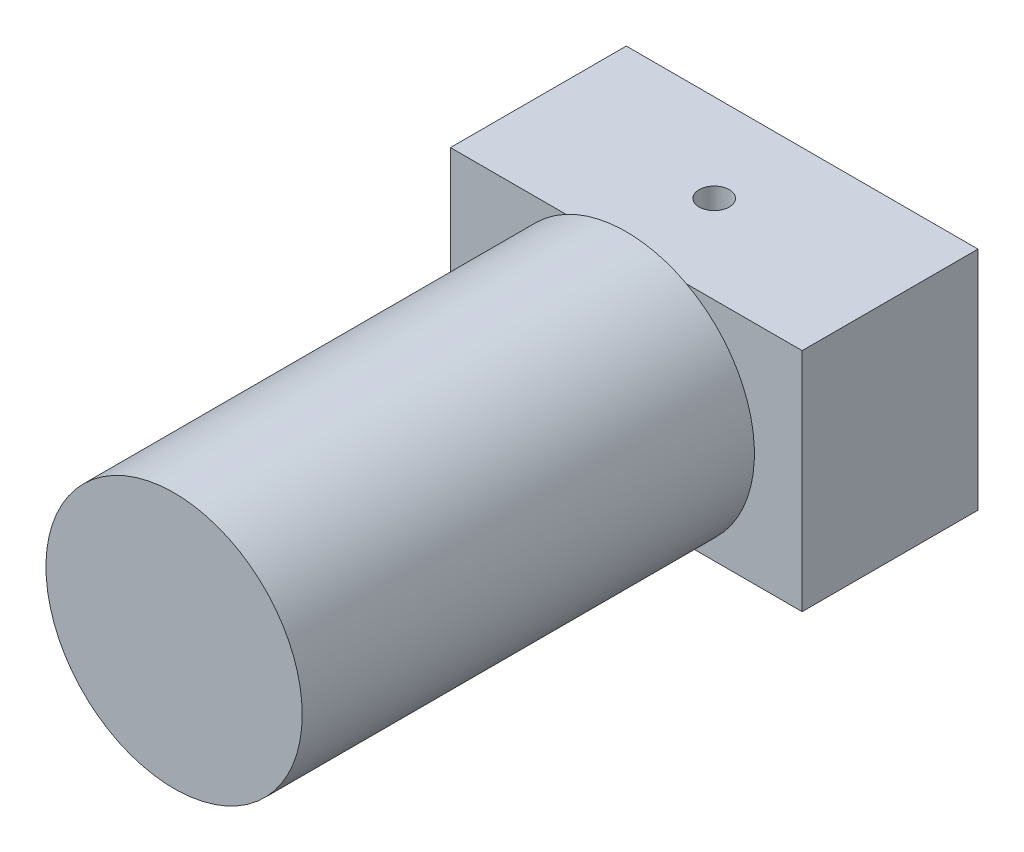
ISO-10303-21;
HEADER;
FILE_DESCRIPTION(('STEP AP214'),'2;1');
FILE_NAME('part.step','',(''),(''),'','','');
FILE_SCHEMA(('AUTOMOTIVE_DESIGN { 1 0 10303 214 1 1 1 1 }'));
ENDSEC;
DATA;
#1=APPLICATION_CONTEXT('core data for automotive mechanical design processes');
#2=APPLICATION_PROTOCOL_DEFINITION('international standard','automotive_design',2000,#1);
#3=PRODUCT_CONTEXT('',#1,'mechanical');
#4=PRODUCT('Part','Part','',(#3));
#5=PRODUCT_RELATED_PRODUCT_CATEGORY('part','',(#4));
#6=PRODUCT_DEFINITION_FORMATION('','',#4);
#7=PRODUCT_DEFINITION_CONTEXT('part definition',#1,'design');
#8=PRODUCT_DEFINITION('design','',#6,#7);
#9=PRODUCT_DEFINITION_SHAPE('','',#8);
#10=(LENGTH_UNIT() NAMED_UNIT(*) SI_UNIT(.MILLI.,.METRE.));
#11=(NAMED_UNIT(*) PLANE_ANGLE_UNIT() SI_UNIT($,.RADIAN.));
#12=(NAMED_UNIT(*) SI_UNIT($,.STERADIAN.) SOLID_ANGLE_UNIT());
#13=UNCERTAINTY_MEASURE_WITH_UNIT(LENGTH_MEASURE(1.E-05),#10,'distance_accuracy_value','');
#14=(GEOMETRIC_REPRESENTATION_CONTEXT(3) GLOBAL_UNCERTAINTY_ASSIGNED_CONTEXT((#13)) GLOBAL_UNIT_ASSIGNED_CONTEXT((#10,
#11,#12)) REPRESENTATION_CONTEXT('',''));
#15=CARTESIAN_POINT('',(0.,0.,0.));
#16=DIRECTION('',(0.,0.,1.));
#17=DIRECTION('',(1.,0.,0.));
#18=AXIS2_PLACEMENT_3D('',#15,#16,#17);
#19=CARTESIAN_POINT('',(0.,0.,35.));
#20=DIRECTION('',(0.,0.,-1.));
#21=DIRECTION('',(-1.,0.,0.));
#22=AXIS2_PLACEMENT_3D('',#19,#20,#21);
#23=PLANE('',#22);
#24=CARTESIAN_POINT('',(0.,0.,35.));
#25=DIRECTION('',(0.,0.,1.));
#26=DIRECTION('',(1.,0.,0.));
#27=AXIS2_PLACEMENT_3D('',#24,#25,#26);
#28=CIRCLE('',#27,25.5);
#29=CARTESIAN_POINT('',(-12.,22.5,35.));
#30=VERTEX_POINT('',#29);
#31=CARTESIAN_POINT('',(-12.,-22.5,35.));
#32=VERTEX_POINT('',#31);
#33=EDGE_CURVE('E11',#30,#32,#28,.T.);
#34=ORIENTED_EDGE('',*,*,#33,.F.);
#35=DIRECTION('',(-1.,0.,0.));
#36=VECTOR('',#35,1.);
#37=CARTESIAN_POINT('',(-35.,22.5,35.));
#38=LINE('',#37,#36);
#39=CARTESIAN_POINT('',(-35.,22.5,35.));
#40=VERTEX_POINT('',#39);
#41=EDGE_CURVE('E101',#30,#40,#38,.T.);
#42=ORIENTED_EDGE('',*,*,#41,.T.);
#43=DIRECTION('',(0.,-1.,0.));
#44=VECTOR('',#43,1.);
#45=CARTESIAN_POINT('',(-35.,-22.5,35.));
#46=LINE('',#45,#44);
#47=CARTESIAN_POINT('',(-35.,-22.5,35.));
#48=VERTEX_POINT('',#47);
#49=EDGE_CURVE('E98',#40,#48,#46,.T.);
#50=ORIENTED_EDGE('',*,*,#49,.T.);
#51=DIRECTION('',(1.,0.,0.));
#52=VECTOR('',#51,1.);
#53=CARTESIAN_POINT('',(-35.,-22.5,35.));
#54=LINE('',#53,#52);
#55=EDGE_CURVE('E126',#48,#32,#54,.T.);
#56=ORIENTED_EDGE('',*,*,#55,.T.);
#57=EDGE_LOOP('',(#34,#42,#50,#56));
#58=FACE_BOUND('',#57,.T.);
#59=ADVANCED_FACE('F36',(#58),#23,.F.);
#60=CARTESIAN_POINT('',(35.,-22.5,35.));
#61=DIRECTION('',(-1.,0.,0.));
#62=DIRECTION('',(0.,0.,1.));
#63=AXIS2_PLACEMENT_3D('',#60,#61,#62);
#64=PLANE('',#63);
#65=DIRECTION('',(0.,1.,0.));
#66=VECTOR('',#65,1.);
#67=CARTESIAN_POINT('',(35.,-22.5,0.));
#68=LINE('',#67,#66);
#69=CARTESIAN_POINT('',(35.,-22.5,0.));
#70=VERTEX_POINT('',#69);
#71=CARTESIAN_POINT('',(35.,22.5,0.));
#72=VERTEX_POINT('',#71);
#73=EDGE_CURVE('E117',#70,#72,#68,.T.);
#74=ORIENTED_EDGE('',*,*,#73,.T.);
#75=DIRECTION('',(0.,0.,-1.));
#76=VECTOR('',#75,1.);
#77=CARTESIAN_POINT('',(35.,22.5,35.));
#78=LINE('',#77,#76);
#79=CARTESIAN_POINT('',(35.,22.5,35.));
#80=VERTEX_POINT('',#79);
#81=EDGE_CURVE('E40',#80,#72,#78,.T.);
#82=ORIENTED_EDGE('',*,*,#81,.F.);
#83=DIRECTION('',(0.,1.,0.));
#84=VECTOR('',#83,1.);
#85=CARTESIAN_POINT('',(35.,-22.5,35.));
#86=LINE('',#85,#84);
#87=CARTESIAN_POINT('',(35.,-22.5,35.));
#88=VERTEX_POINT('',#87);
#89=EDGE_CURVE('E94',#88,#80,#86,.T.);
#90=ORIENTED_EDGE('',*,*,#89,.F.);
#91=DIRECTION('',(0.,0.,-1.));
#92=VECTOR('',#91,1.);
#93=CARTESIAN_POINT('',(35.,-22.5,35.));
#94=LINE('',#93,#92);
#95=EDGE_CURVE('E128',#88,#70,#94,.T.);
#96=ORIENTED_EDGE('',*,*,#95,.T.);
#97=EDGE_LOOP('',(#74,#82,#90,#96));
#98=FACE_BOUND('',#97,.T.);
#99=ADVANCED_FACE('F38',(#98),#64,.F.);
#100=CARTESIAN_POINT('',(-35.,22.5,35.));
#101=DIRECTION('',(0.,-1.,0.));
#102=DIRECTION('',(0.,0.,-1.));
#103=AXIS2_PLACEMENT_3D('',#100,#101,#102);
#104=PLANE('',#103);
#105=CARTESIAN_POINT('',(0.,22.5,17.5));
#106=DIRECTION('',(0.,1.,0.));
#107=DIRECTION('',(0.,0.,1.));
#108=AXIS2_PLACEMENT_3D('',#105,#106,#107);
#109=CIRCLE('',#108,3.);
#110=CARTESIAN_POINT('',(0.,22.5,20.5));
#111=VERTEX_POINT('',#110);
#112=EDGE_CURVE('E189',#111,#111,#109,.T.);
#113=ORIENTED_EDGE('',*,*,#112,.F.);
#114=EDGE_LOOP('',(#113));
#115=FACE_BOUND('',#114,.T.);
#116=DIRECTION('',(-1.,0.,0.));
#117=VECTOR('',#116,1.);
#118=CARTESIAN_POINT('',(-35.,22.5,0.));
#119=LINE('',#118,#117);
#120=CARTESIAN_POINT('',(-35.,22.5,0.));
#121=VERTEX_POINT('',#120);
#122=EDGE_CURVE('E131',#72,#121,#119,.T.);
#123=ORIENTED_EDGE('',*,*,#122,.T.);
#124=DIRECTION('',(0.,0.,-1.));
#125=VECTOR('',#124,1.);
#126=CARTESIAN_POINT('',(-35.,22.5,35.));
#127=LINE('',#126,#125);
#128=EDGE_CURVE('E140',#40,#121,#127,.T.);
#129=ORIENTED_EDGE('',*,*,#128,.F.);
#130=ORIENTED_EDGE('',*,*,#41,.F.);
#131=CARTESIAN_POINT('',(12.,22.5,35.));
#132=VERTEX_POINT('',#131);
#133=EDGE_CURVE('E99',#132,#30,#38,.T.);
#134=ORIENTED_EDGE('',*,*,#133,.F.);
#135=EDGE_CURVE('E90',#80,#132,#38,.T.);
#136=ORIENTED_EDGE('',*,*,#135,.F.);
#137=ORIENTED_EDGE('',*,*,#81,.T.);
#138=EDGE_LOOP('',(#123,#129,#130,#134,#136,#137));
#139=FACE_BOUND('',#138,.T.);
#140=ADVANCED_FACE('F104',(#115,#139),#104,.F.);
#141=CARTESIAN_POINT('',(-35.,-22.5,35.));
#142=DIRECTION('',(1.,0.,0.));
#143=DIRECTION('',(0.,0.,-1.));
#144=AXIS2_PLACEMENT_3D('',#141,#142,#143);
#145=PLANE('',#144);
#146=DIRECTION('',(0.,-1.,0.));
#147=VECTOR('',#146,1.);
#148=CARTESIAN_POINT('',(-35.,-22.5,0.));
#149=LINE('',#148,#147);
#150=CARTESIAN_POINT('',(-35.,-22.5,0.));
#151=VERTEX_POINT('',#150);
#152=EDGE_CURVE('E133',#121,#151,#149,.T.);
#153=ORIENTED_EDGE('',*,*,#152,.T.);
#154=DIRECTION('',(0.,0.,-1.));
#155=VECTOR('',#154,1.);
#156=CARTESIAN_POINT('',(-35.,-22.5,35.));
#157=LINE('',#156,#155);
#158=EDGE_CURVE('E138',#48,#151,#157,.T.);
#159=ORIENTED_EDGE('',*,*,#158,.F.);
#160=ORIENTED_EDGE('',*,*,#49,.F.);
#161=ORIENTED_EDGE('',*,*,#128,.T.);
#162=EDGE_LOOP('',(#153,#159,#160,#161));
#163=FACE_BOUND('',#162,.T.);
#164=ADVANCED_FACE('F152',(#163),#145,.F.);
#165=CARTESIAN_POINT('',(-35.,-22.5,35.));
#166=DIRECTION('',(0.,1.,0.));
#167=DIRECTION('',(0.,0.,1.));
#168=AXIS2_PLACEMENT_3D('',#165,#166,#167);
#169=PLANE('',#168);
#170=DIRECTION('',(1.,0.,0.));
#171=VECTOR('',#170,1.);
#172=CARTESIAN_POINT('',(-35.,-22.5,0.));
#173=LINE('',#172,#171);
#174=EDGE_CURVE('E122',#151,#70,#173,.T.);
#175=ORIENTED_EDGE('',*,*,#174,.T.);
#176=ORIENTED_EDGE('',*,*,#95,.F.);
#177=CARTESIAN_POINT('',(12.,-22.5,35.));
#178=VERTEX_POINT('',#177);
#179=EDGE_CURVE('E125',#178,#88,#54,.T.);
#180=ORIENTED_EDGE('',*,*,#179,.F.);
#181=EDGE_CURVE('E60',#32,#178,#54,.T.);
#182=ORIENTED_EDGE('',*,*,#181,.F.);
#183=ORIENTED_EDGE('',*,*,#55,.F.);
#184=ORIENTED_EDGE('',*,*,#158,.T.);
#185=EDGE_LOOP('',(#175,#176,#180,#182,#183,#184));
#186=FACE_BOUND('',#185,.T.);
#187=ADVANCED_FACE('F153',(#186),#169,.F.);
#188=EDGE_CURVE('E45',#178,#132,#28,.T.);
#189=ORIENTED_EDGE('',*,*,#188,.F.);
#190=ORIENTED_EDGE('',*,*,#179,.T.);
#191=ORIENTED_EDGE('',*,*,#89,.T.);
#192=ORIENTED_EDGE('',*,*,#135,.T.);
#193=EDGE_LOOP('',(#189,#190,#191,#192));
#194=FACE_BOUND('',#193,.T.);
#195=ADVANCED_FACE('F92',(#194),#23,.F.);
#196=CARTESIAN_POINT('',(0.,0.,0.));
#197=DIRECTION('',(0.,0.,-1.));
#198=DIRECTION('',(-1.,0.,0.));
#199=AXIS2_PLACEMENT_3D('',#196,#197,#198);
#200=PLANE('',#199);
#201=ORIENTED_EDGE('',*,*,#73,.F.);
#202=ORIENTED_EDGE('',*,*,#174,.F.);
#203=ORIENTED_EDGE('',*,*,#152,.F.);
#204=ORIENTED_EDGE('',*,*,#122,.F.);
#205=EDGE_LOOP('',(#201,#202,#203,#204));
#206=FACE_BOUND('',#205,.T.);
#207=ADVANCED_FACE('F150',(#206),#200,.T.);
#208=CARTESIAN_POINT('',(0.,0.,35.));
#209=DIRECTION('',(0.,0.,1.));
#210=DIRECTION('',(1.,0.,0.));
#211=AXIS2_PLACEMENT_3D('',#208,#209,#210);
#212=PLANE('',#211);
#213=EDGE_CURVE('E112',#132,#30,#28,.T.);
#214=ORIENTED_EDGE('',*,*,#213,.F.);
#215=ORIENTED_EDGE('',*,*,#133,.T.);
#216=EDGE_LOOP('',(#214,#215));
#217=FACE_BOUND('',#216,.T.);
#218=ADVANCED_FACE('F114',(#217),#212,.F.);
#219=EDGE_CURVE('E47',#32,#178,#28,.T.);
#220=ORIENTED_EDGE('',*,*,#219,.F.);
#221=ORIENTED_EDGE('',*,*,#181,.T.);
#222=EDGE_LOOP('',(#220,#221));
#223=FACE_BOUND('',#222,.T.);
#224=ADVANCED_FACE('F156',(#223),#212,.F.);
#225=CARTESIAN_POINT('',(0.,0.,125.));
#226=DIRECTION('',(0.,0.,-1.));
#227=DIRECTION('',(-1.,0.,0.));
#228=AXIS2_PLACEMENT_3D('',#225,#226,#227);
#229=CYLINDRICAL_SURFACE('',#228,25.5);
#230=CARTESIAN_POINT('',(0.,0.,125.));
#231=DIRECTION('',(0.,0.,1.));
#232=DIRECTION('',(1.,0.,0.));
#233=AXIS2_PLACEMENT_3D('',#230,#231,#232);
#234=CIRCLE('',#233,25.5);
#235=CARTESIAN_POINT('',(25.5,0.,125.));
#236=VERTEX_POINT('',#235);
#237=EDGE_CURVE('E115',#236,#236,#234,.T.);
#238=ORIENTED_EDGE('',*,*,#237,.F.);
#239=EDGE_LOOP('',(#238));
#240=FACE_BOUND('',#239,.T.);
#241=ORIENTED_EDGE('',*,*,#213,.T.);
#242=ORIENTED_EDGE('',*,*,#33,.T.);
#243=ORIENTED_EDGE('',*,*,#219,.T.);
#244=ORIENTED_EDGE('',*,*,#188,.T.);
#245=EDGE_LOOP('',(#241,#242,#243,#244));
#246=FACE_BOUND('',#245,.T.);
#247=ADVANCED_FACE('F111',(#240,#246),#229,.T.);
#248=CARTESIAN_POINT('',(0.,0.,125.));
#249=DIRECTION('',(0.,0.,1.));
#250=DIRECTION('',(1.,0.,0.));
#251=AXIS2_PLACEMENT_3D('',#248,#249,#250);
#252=PLANE('',#251);
#253=ORIENTED_EDGE('',*,*,#237,.T.);
#254=EDGE_LOOP('',(#253));
#255=FACE_BOUND('',#254,.T.);
#256=ADVANCED_FACE('F163',(#255),#252,.T.);
#257=CARTESIAN_POINT('',(0.,12.5,17.5));
#258=DIRECTION('',(0.,1.,0.));
#259=DIRECTION('',(0.,0.,1.));
#260=AXIS2_PLACEMENT_3D('',#257,#258,#259);
#261=CYLINDRICAL_SURFACE('',#260,3.);
#262=CARTESIAN_POINT('',(0.,12.5,17.5));
#263=DIRECTION('',(0.,1.,0.));
#264=DIRECTION('',(0.,0.,1.));
#265=AXIS2_PLACEMENT_3D('',#262,#263,#264);
#266=CIRCLE('',#265,3.);
#267=CARTESIAN_POINT('',(0.,12.5,20.5));
#268=VERTEX_POINT('',#267);
#269=EDGE_CURVE('E119',#268,#268,#266,.T.);
#270=ORIENTED_EDGE('',*,*,#269,.F.);
#271=EDGE_LOOP('',(#270));
#272=FACE_BOUND('',#271,.T.);
#273=ORIENTED_EDGE('',*,*,#112,.T.);
#274=EDGE_LOOP('',(#273));
#275=FACE_BOUND('',#274,.T.);
#276=ADVANCED_FACE('F197',(#272,#275),#261,.F.);
#277=CARTESIAN_POINT('',(0.,12.5,17.5));
#278=DIRECTION('',(0.,1.,0.));
#279=DIRECTION('',(0.,0.,1.));
#280=AXIS2_PLACEMENT_3D('',#277,#278,#279);
#281=PLANE('',#280);
#282=ORIENTED_EDGE('',*,*,#269,.T.);
#283=EDGE_LOOP('',(#282));
#284=FACE_BOUND('',#283,.T.);
#285=ADVANCED_FACE('F195',(#284),#281,.T.);
#286=CLOSED_SHELL('',(#59,#99,#140,#164,#187,#195,#207,#218,#224,#247,#256,#276,#285));
#287=MANIFOLD_SOLID_BREP('B2',#286);
#288=ADVANCED_BREP_SHAPE_REPRESENTATION('',(#18,#287),#14);
#289=SHAPE_DEFINITION_REPRESENTATION(#9,#288);
ENDSEC;
END-ISO-10303-21;
